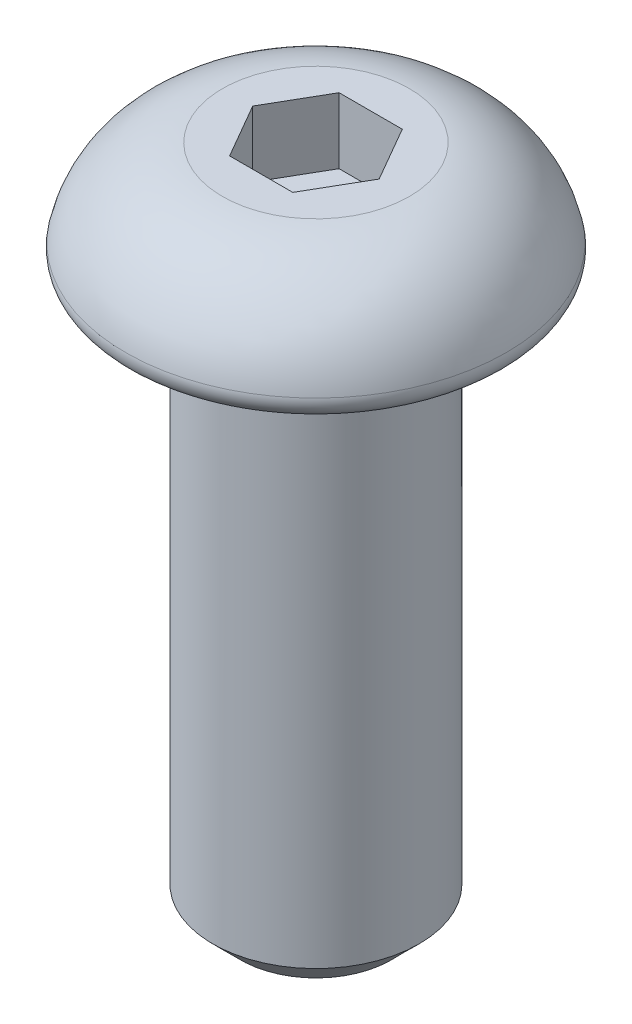
ISO-10303-21;
HEADER;
FILE_DESCRIPTION(('STEP AP214'),'2;1');
FILE_NAME('part.step','',(''),(''),'','','');
FILE_SCHEMA(('AUTOMOTIVE_DESIGN { 1 0 10303 214 1 1 1 1 }'));
ENDSEC;
DATA;
#1=APPLICATION_CONTEXT('core data for automotive mechanical design processes');
#2=APPLICATION_PROTOCOL_DEFINITION('international standard','automotive_design',2000,#1);
#3=PRODUCT_CONTEXT('',#1,'mechanical');
#4=PRODUCT('Part','Part','',(#3));
#5=PRODUCT_RELATED_PRODUCT_CATEGORY('part','',(#4));
#6=PRODUCT_DEFINITION_FORMATION('','',#4);
#7=PRODUCT_DEFINITION_CONTEXT('part definition',#1,'design');
#8=PRODUCT_DEFINITION('design','',#6,#7);
#9=PRODUCT_DEFINITION_SHAPE('','',#8);
#10=(LENGTH_UNIT() NAMED_UNIT(*) SI_UNIT(.MILLI.,.METRE.));
#11=(NAMED_UNIT(*) PLANE_ANGLE_UNIT() SI_UNIT($,.RADIAN.));
#12=(NAMED_UNIT(*) SI_UNIT($,.STERADIAN.) SOLID_ANGLE_UNIT());
#13=UNCERTAINTY_MEASURE_WITH_UNIT(LENGTH_MEASURE(1.E-05),#10,'distance_accuracy_value','');
#14=(GEOMETRIC_REPRESENTATION_CONTEXT(3) GLOBAL_UNCERTAINTY_ASSIGNED_CONTEXT((#13)) GLOBAL_UNIT_ASSIGNED_CONTEXT((#10,
#11,#12)) REPRESENTATION_CONTEXT('',''));
#15=CARTESIAN_POINT('',(0.,0.,0.));
#16=DIRECTION('',(0.,0.,1.));
#17=DIRECTION('',(1.,0.,0.));
#18=AXIS2_PLACEMENT_3D('',#15,#16,#17);
#19=CARTESIAN_POINT('',(0.,0.,0.));
#20=DIRECTION('',(0.,-1.,0.));
#21=DIRECTION('',(1.,0.,0.));
#22=AXIS2_PLACEMENT_3D('',#19,#20,#21);
#23=PLANE('',#22);
#24=CARTESIAN_POINT('',(0.,0.,0.));
#25=DIRECTION('',(0.,-1.,0.));
#26=DIRECTION('',(1.,0.,0.));
#27=AXIS2_PLACEMENT_3D('',#24,#25,#26);
#28=CIRCLE('',#27,2.0689086457345);
#29=CARTESIAN_POINT('',(2.0689086457345,0.,0.));
#30=VERTEX_POINT('',#29);
#31=EDGE_CURVE('E41',#30,#30,#28,.F.);
#32=ORIENTED_EDGE('',*,*,#31,.T.);
#33=EDGE_LOOP('',(#32));
#34=FACE_BOUND('',#33,.T.);
#35=CARTESIAN_POINT('',(0.,0.,0.));
#36=DIRECTION('',(0.,-1.,0.));
#37=DIRECTION('',(1.,0.,0.));
#38=AXIS2_PLACEMENT_3D('',#35,#36,#37);
#39=CIRCLE('',#38,2.921560184454);
#40=CARTESIAN_POINT('',(2.921560184454,0.,0.));
#41=VERTEX_POINT('',#40);
#42=EDGE_CURVE('E152',#41,#41,#39,.T.);
#43=ORIENTED_EDGE('',*,*,#42,.T.);
#44=EDGE_LOOP('',(#43));
#45=FACE_BOUND('',#44,.T.);
#46=ADVANCED_FACE('F33',(#34,#45),#23,.T.);
#47=CARTESIAN_POINT('',(0.,0.,0.));
#48=DIRECTION('',(0.,-1.,0.));
#49=DIRECTION('',(1.,0.,0.));
#50=AXIS2_PLACEMENT_3D('',#47,#48,#49);
#51=DEGENERATE_TOROIDAL_SURFACE('',#50,1.40765892856977,1.86290108459299,.T.);
#52=CARTESIAN_POINT('',(0.,0.380999999999906,0.));
#53=DIRECTION('',(0.,-1.,0.));
#54=DIRECTION('',(1.,0.,0.));
#55=AXIS2_PLACEMENT_3D('',#52,#53,#54);
#56=CIRCLE('',#55,3.23118283874419);
#57=CARTESIAN_POINT('',(3.23118283874419,0.380999999999907,0.));
#58=VERTEX_POINT('',#57);
#59=EDGE_CURVE('E11',#58,#58,#56,.F.);
#60=ORIENTED_EDGE('',*,*,#59,.T.);
#61=EDGE_LOOP('',(#60));
#62=FACE_BOUND('',#61,.T.);
#63=CARTESIAN_POINT('',(0.,1.85420000000036,0.));
#64=DIRECTION('',(0.,-1.,0.));
#65=DIRECTION('',(1.,0.,0.));
#66=AXIS2_PLACEMENT_3D('',#63,#64,#65);
#67=CIRCLE('',#66,1.58750000000907);
#68=CARTESIAN_POINT('',(1.58750000000907,1.85420000000036,0.));
#69=VERTEX_POINT('',#68);
#70=EDGE_CURVE('E135',#69,#69,#67,.T.);
#71=ORIENTED_EDGE('',*,*,#70,.T.);
#72=EDGE_LOOP('',(#71));
#73=FACE_BOUND('',#72,.T.);
#74=ADVANCED_FACE('F187',(#62,#73),#51,.T.);
#75=CARTESIAN_POINT('',(1.58750000000907,1.85420000000036,0.));
#76=DIRECTION('',(0.,1.,0.));
#77=DIRECTION('',(-1.,0.,0.));
#78=AXIS2_PLACEMENT_3D('',#75,#76,#77);
#79=PLANE('',#78);
#80=DIRECTION('',(-1.,0.,0.));
#81=VECTOR('',#80,1.);
#82=CARTESIAN_POINT('',(0.536574999999984,1.85420000000036,-0.929375162071291));
#83=LINE('',#82,#81);
#84=CARTESIAN_POINT('',(0.536574999999984,1.85420000000036,-0.929375162071291));
#85=VERTEX_POINT('',#84);
#86=CARTESIAN_POINT('',(-0.536575,1.85420000000036,-0.9293751620713));
#87=VERTEX_POINT('',#86);
#88=EDGE_CURVE('E48',#85,#87,#83,.T.);
#89=ORIENTED_EDGE('',*,*,#88,.F.);
#90=DIRECTION('',(-0.50000000000001,0.,-0.866025403784433));
#91=VECTOR('',#90,1.);
#92=CARTESIAN_POINT('',(1.07315000000002,1.85420000000036,0.));
#93=LINE('',#92,#91);
#94=CARTESIAN_POINT('',(1.07315000000002,1.85420000000036,0.));
#95=VERTEX_POINT('',#94);
#96=EDGE_CURVE('E131',#95,#85,#93,.T.);
#97=ORIENTED_EDGE('',*,*,#96,.F.);
#98=DIRECTION('',(0.500000000000002,0.,-0.866025403784437));
#99=VECTOR('',#98,1.);
#100=CARTESIAN_POINT('',(0.536575,1.85420000000036,0.9293751620713));
#101=LINE('',#100,#99);
#102=CARTESIAN_POINT('',(0.536575,1.85420000000036,0.9293751620713));
#103=VERTEX_POINT('',#102);
#104=EDGE_CURVE('E129',#103,#95,#101,.T.);
#105=ORIENTED_EDGE('',*,*,#104,.F.);
#106=DIRECTION('',(1.,0.,0.));
#107=VECTOR('',#106,1.);
#108=CARTESIAN_POINT('',(-0.536574999999992,1.85420000000036,0.929375162071296));
#109=LINE('',#108,#107);
#110=CARTESIAN_POINT('',(-0.536574999999992,1.85420000000036,0.929375162071296));
#111=VERTEX_POINT('',#110);
#112=EDGE_CURVE('E96',#111,#103,#109,.T.);
#113=ORIENTED_EDGE('',*,*,#112,.F.);
#114=DIRECTION('',(0.500000000000002,0.,0.866025403784437));
#115=VECTOR('',#114,1.);
#116=CARTESIAN_POINT('',(-1.07315000000002,1.85420000000036,0.));
#117=LINE('',#116,#115);
#118=CARTESIAN_POINT('',(-1.07315000000002,1.85420000000036,0.));
#119=VERTEX_POINT('',#118);
#120=EDGE_CURVE('E125',#119,#111,#117,.T.);
#121=ORIENTED_EDGE('',*,*,#120,.F.);
#122=DIRECTION('',(-0.500000000000002,0.,0.866025403784437));
#123=VECTOR('',#122,1.);
#124=CARTESIAN_POINT('',(-0.536575,1.85420000000036,-0.9293751620713));
#125=LINE('',#124,#123);
#126=EDGE_CURVE('E122',#87,#119,#125,.T.);
#127=ORIENTED_EDGE('',*,*,#126,.F.);
#128=EDGE_LOOP('',(#89,#97,#105,#113,#121,#127));
#129=FACE_BOUND('',#128,.T.);
#130=ORIENTED_EDGE('',*,*,#70,.F.);
#131=EDGE_LOOP('',(#130));
#132=FACE_BOUND('',#131,.T.);
#133=ADVANCED_FACE('F169',(#129,#132),#79,.T.);
#134=CARTESIAN_POINT('',(0.,-9.525,0.));
#135=DIRECTION('',(0.,1.,0.));
#136=DIRECTION('',(0.,0.,1.));
#137=AXIS2_PLACEMENT_3D('',#134,#135,#136);
#138=CYLINDRICAL_SURFACE('',#137,1.7526);
#139=CARTESIAN_POINT('',(0.,-0.3163086457345,0.));
#140=DIRECTION('',(0.,-1.,0.));
#141=DIRECTION('',(1.,0.,0.));
#142=AXIS2_PLACEMENT_3D('',#139,#140,#141);
#143=CIRCLE('',#142,1.7526);
#144=CARTESIAN_POINT('',(1.7526,-0.3163086457345,0.));
#145=VERTEX_POINT('',#144);
#146=EDGE_CURVE('E149',#145,#145,#143,.T.);
#147=ORIENTED_EDGE('',*,*,#146,.T.);
#148=EDGE_LOOP('',(#147));
#149=FACE_BOUND('',#148,.T.);
#150=CARTESIAN_POINT('',(0.,-9.05255999995575,0.));
#151=DIRECTION('',(0.,-1.,0.));
#152=DIRECTION('',(0.,0.,-1.));
#153=AXIS2_PLACEMENT_3D('',#150,#151,#152);
#154=CIRCLE('',#153,1.7526);
#155=CARTESIAN_POINT('',(0.,-9.05255999995575,-1.7526));
#156=VERTEX_POINT('',#155);
#157=EDGE_CURVE('E146',#156,#156,#154,.F.);
#158=ORIENTED_EDGE('',*,*,#157,.T.);
#159=EDGE_LOOP('',(#158));
#160=FACE_BOUND('',#159,.T.);
#161=ADVANCED_FACE('F165',(#149,#160),#138,.T.);
#162=CARTESIAN_POINT('',(0.,-9.525,0.));
#163=DIRECTION('',(0.,-1.,0.));
#164=DIRECTION('',(0.,0.,-1.));
#165=AXIS2_PLACEMENT_3D('',#162,#163,#164);
#166=PLANE('',#165);
#167=CARTESIAN_POINT('',(0.,-9.525,0.));
#168=DIRECTION('',(0.,-1.,0.));
#169=DIRECTION('',(0.,0.,-1.));
#170=AXIS2_PLACEMENT_3D('',#167,#168,#169);
#171=CIRCLE('',#170,1.28016000001259);
#172=CARTESIAN_POINT('',(0.,-9.525,-1.28016000001259));
#173=VERTEX_POINT('',#172);
#174=EDGE_CURVE('E143',#173,#173,#171,.T.);
#175=ORIENTED_EDGE('',*,*,#174,.T.);
#176=EDGE_LOOP('',(#175));
#177=FACE_BOUND('',#176,.T.);
#178=ADVANCED_FACE('F168',(#177),#166,.T.);
#179=CARTESIAN_POINT('',(0.536574999999984,0.736600000000355,-0.929375162071291));
#180=DIRECTION('',(0.,0.,-1.));
#181=DIRECTION('',(-1.,0.,0.));
#182=AXIS2_PLACEMENT_3D('',#179,#180,#181);
#183=PLANE('',#182);
#184=ORIENTED_EDGE('',*,*,#88,.T.);
#185=DIRECTION('',(0.,1.,0.));
#186=VECTOR('',#185,1.);
#187=CARTESIAN_POINT('',(-0.536575,0.736600000000355,-0.9293751620713));
#188=LINE('',#187,#186);
#189=CARTESIAN_POINT('',(-0.536575,0.736600000000355,-0.9293751620713));
#190=VERTEX_POINT('',#189);
#191=EDGE_CURVE('E78',#190,#87,#188,.T.);
#192=ORIENTED_EDGE('',*,*,#191,.F.);
#193=DIRECTION('',(-1.,0.,0.));
#194=VECTOR('',#193,1.);
#195=CARTESIAN_POINT('',(0.536574999999984,0.736600000000355,-0.929375162071291));
#196=LINE('',#195,#194);
#197=CARTESIAN_POINT('',(0.536574999999984,0.736600000000355,-0.929375162071291));
#198=VERTEX_POINT('',#197);
#199=EDGE_CURVE('E133',#198,#190,#196,.T.);
#200=ORIENTED_EDGE('',*,*,#199,.F.);
#201=DIRECTION('',(0.,1.,0.));
#202=VECTOR('',#201,1.);
#203=CARTESIAN_POINT('',(0.536574999999984,0.736600000000355,-0.929375162071291));
#204=LINE('',#203,#202);
#205=EDGE_CURVE('E56',#198,#85,#204,.T.);
#206=ORIENTED_EDGE('',*,*,#205,.T.);
#207=EDGE_LOOP('',(#184,#192,#200,#206));
#208=FACE_BOUND('',#207,.T.);
#209=ADVANCED_FACE('F179',(#208),#183,.F.);
#210=CARTESIAN_POINT('',(1.07315000000002,0.736600000000355,0.));
#211=DIRECTION('',(0.866025403784433,0.,-0.500000000000009));
#212=DIRECTION('',(-0.50000000000001,0.,-0.866025403784433));
#213=AXIS2_PLACEMENT_3D('',#210,#211,#212);
#214=PLANE('',#213);
#215=ORIENTED_EDGE('',*,*,#96,.T.);
#216=ORIENTED_EDGE('',*,*,#205,.F.);
#217=DIRECTION('',(-0.50000000000001,0.,-0.866025403784433));
#218=VECTOR('',#217,1.);
#219=CARTESIAN_POINT('',(1.07315000000002,0.736600000000355,0.));
#220=LINE('',#219,#218);
#221=CARTESIAN_POINT('',(1.07315000000002,0.736600000000355,0.));
#222=VERTEX_POINT('',#221);
#223=EDGE_CURVE('E108',#222,#198,#220,.T.);
#224=ORIENTED_EDGE('',*,*,#223,.F.);
#225=DIRECTION('',(0.,1.,0.));
#226=VECTOR('',#225,1.);
#227=CARTESIAN_POINT('',(1.07315000000002,0.736600000000355,0.));
#228=LINE('',#227,#226);
#229=EDGE_CURVE('E100',#222,#95,#228,.T.);
#230=ORIENTED_EDGE('',*,*,#229,.T.);
#231=EDGE_LOOP('',(#215,#216,#224,#230));
#232=FACE_BOUND('',#231,.T.);
#233=ADVANCED_FACE('F184',(#232),#214,.F.);
#234=CARTESIAN_POINT('',(0.536575,0.736600000000355,0.9293751620713));
#235=DIRECTION('',(0.866025403784437,0.,0.500000000000002));
#236=DIRECTION('',(0.500000000000002,0.,-0.866025403784437));
#237=AXIS2_PLACEMENT_3D('',#234,#235,#236);
#238=PLANE('',#237);
#239=ORIENTED_EDGE('',*,*,#104,.T.);
#240=ORIENTED_EDGE('',*,*,#229,.F.);
#241=DIRECTION('',(0.500000000000002,0.,-0.866025403784437));
#242=VECTOR('',#241,1.);
#243=CARTESIAN_POINT('',(0.536575,0.736600000000355,0.9293751620713));
#244=LINE('',#243,#242);
#245=CARTESIAN_POINT('',(0.536575,0.736600000000355,0.9293751620713));
#246=VERTEX_POINT('',#245);
#247=EDGE_CURVE('E104',#246,#222,#244,.T.);
#248=ORIENTED_EDGE('',*,*,#247,.F.);
#249=DIRECTION('',(0.,1.,0.));
#250=VECTOR('',#249,1.);
#251=CARTESIAN_POINT('',(0.536575,0.736600000000355,0.9293751620713));
#252=LINE('',#251,#250);
#253=EDGE_CURVE('E89',#246,#103,#252,.T.);
#254=ORIENTED_EDGE('',*,*,#253,.T.);
#255=EDGE_LOOP('',(#239,#240,#248,#254));
#256=FACE_BOUND('',#255,.T.);
#257=ADVANCED_FACE('F105',(#256),#238,.F.);
#258=CARTESIAN_POINT('',(-0.536574999999992,0.736600000000355,0.929375162071296));
#259=DIRECTION('',(0.,0.,1.));
#260=DIRECTION('',(1.,0.,0.));
#261=AXIS2_PLACEMENT_3D('',#258,#259,#260);
#262=PLANE('',#261);
#263=ORIENTED_EDGE('',*,*,#112,.T.);
#264=ORIENTED_EDGE('',*,*,#253,.F.);
#265=DIRECTION('',(1.,0.,0.));
#266=VECTOR('',#265,1.);
#267=CARTESIAN_POINT('',(-0.536574999999992,0.736600000000355,0.929375162071296));
#268=LINE('',#267,#266);
#269=CARTESIAN_POINT('',(-0.536574999999992,0.736600000000355,0.929375162071296));
#270=VERTEX_POINT('',#269);
#271=EDGE_CURVE('E93',#270,#246,#268,.T.);
#272=ORIENTED_EDGE('',*,*,#271,.F.);
#273=DIRECTION('',(0.,1.,0.));
#274=VECTOR('',#273,1.);
#275=CARTESIAN_POINT('',(-0.536574999999992,0.736600000000355,0.929375162071296));
#276=LINE('',#275,#274);
#277=EDGE_CURVE('E101',#270,#111,#276,.T.);
#278=ORIENTED_EDGE('',*,*,#277,.T.);
#279=EDGE_LOOP('',(#263,#264,#272,#278));
#280=FACE_BOUND('',#279,.T.);
#281=ADVANCED_FACE('F91',(#280),#262,.F.);
#282=CARTESIAN_POINT('',(-1.07315000000002,0.736600000000355,0.));
#283=DIRECTION('',(-0.866025403784437,0.,0.500000000000002));
#284=DIRECTION('',(0.500000000000002,0.,0.866025403784437));
#285=AXIS2_PLACEMENT_3D('',#282,#283,#284);
#286=PLANE('',#285);
#287=ORIENTED_EDGE('',*,*,#120,.T.);
#288=ORIENTED_EDGE('',*,*,#277,.F.);
#289=DIRECTION('',(0.500000000000002,0.,0.866025403784437));
#290=VECTOR('',#289,1.);
#291=CARTESIAN_POINT('',(-1.07315000000002,0.736600000000355,0.));
#292=LINE('',#291,#290);
#293=CARTESIAN_POINT('',(-1.07315000000002,0.736600000000355,0.));
#294=VERTEX_POINT('',#293);
#295=EDGE_CURVE('E114',#294,#270,#292,.T.);
#296=ORIENTED_EDGE('',*,*,#295,.F.);
#297=DIRECTION('',(0.,1.,0.));
#298=VECTOR('',#297,1.);
#299=CARTESIAN_POINT('',(-1.07315000000002,0.736600000000355,0.));
#300=LINE('',#299,#298);
#301=EDGE_CURVE('E138',#294,#119,#300,.T.);
#302=ORIENTED_EDGE('',*,*,#301,.T.);
#303=EDGE_LOOP('',(#287,#288,#296,#302));
#304=FACE_BOUND('',#303,.T.);
#305=ADVANCED_FACE('F218',(#304),#286,.F.);
#306=CARTESIAN_POINT('',(-0.536575,0.736600000000355,-0.9293751620713));
#307=DIRECTION('',(-0.866025403784437,0.,-0.500000000000002));
#308=DIRECTION('',(-0.500000000000002,0.,0.866025403784437));
#309=AXIS2_PLACEMENT_3D('',#306,#307,#308);
#310=PLANE('',#309);
#311=ORIENTED_EDGE('',*,*,#126,.T.);
#312=ORIENTED_EDGE('',*,*,#301,.F.);
#313=DIRECTION('',(-0.500000000000002,0.,0.866025403784437));
#314=VECTOR('',#313,1.);
#315=CARTESIAN_POINT('',(-0.536575,0.736600000000355,-0.9293751620713));
#316=LINE('',#315,#314);
#317=EDGE_CURVE('E116',#190,#294,#316,.T.);
#318=ORIENTED_EDGE('',*,*,#317,.F.);
#319=ORIENTED_EDGE('',*,*,#191,.T.);
#320=EDGE_LOOP('',(#311,#312,#318,#319));
#321=FACE_BOUND('',#320,.T.);
#322=ADVANCED_FACE('F206',(#321),#310,.F.);
#323=CARTESIAN_POINT('',(0.,0.736600000000355,0.));
#324=DIRECTION('',(0.,1.,0.));
#325=DIRECTION('',(0.,0.,1.));
#326=AXIS2_PLACEMENT_3D('',#323,#324,#325);
#327=PLANE('',#326);
#328=ORIENTED_EDGE('',*,*,#199,.T.);
#329=ORIENTED_EDGE('',*,*,#317,.T.);
#330=ORIENTED_EDGE('',*,*,#295,.T.);
#331=ORIENTED_EDGE('',*,*,#271,.T.);
#332=ORIENTED_EDGE('',*,*,#247,.T.);
#333=ORIENTED_EDGE('',*,*,#223,.T.);
#334=EDGE_LOOP('',(#328,#329,#330,#331,#332,#333));
#335=FACE_BOUND('',#334,.T.);
#336=ADVANCED_FACE('F111',(#335),#327,.T.);
#337=CARTESIAN_POINT('',(0.,-9.525,0.));
#338=DIRECTION('',(0.,1.,0.));
#339=DIRECTION('',(0.,0.,1.));
#340=AXIS2_PLACEMENT_3D('',#337,#338,#339);
#341=CONICAL_SURFACE('',#340,1.28016000001259,0.785398163337286);
#342=ORIENTED_EDGE('',*,*,#157,.F.);
#343=EDGE_LOOP('',(#342));
#344=FACE_BOUND('',#343,.T.);
#345=ORIENTED_EDGE('',*,*,#174,.F.);
#346=EDGE_LOOP('',(#345));
#347=FACE_BOUND('',#346,.T.);
#348=ADVANCED_FACE('F162',(#344,#347),#341,.T.);
#349=CARTESIAN_POINT('',(0.,-0.3163086457345,0.));
#350=DIRECTION('',(0.,-1.,0.));
#351=DIRECTION('',(1.,0.,0.));
#352=AXIS2_PLACEMENT_3D('',#349,#350,#351);
#353=TOROIDAL_SURFACE('',#352,2.0689086457345,0.3163086457345);
#354=ORIENTED_EDGE('',*,*,#31,.F.);
#355=EDGE_LOOP('',(#354));
#356=FACE_BOUND('',#355,.T.);
#357=ORIENTED_EDGE('',*,*,#146,.F.);
#358=EDGE_LOOP('',(#357));
#359=FACE_BOUND('',#358,.T.);
#360=ADVANCED_FACE('F159',(#356,#359),#353,.F.);
#361=CARTESIAN_POINT('',(0.,0.3163086457345,0.));
#362=DIRECTION('',(0.,-1.,0.));
#363=DIRECTION('',(1.,0.,0.));
#364=AXIS2_PLACEMENT_3D('',#361,#362,#363);
#365=TOROIDAL_SURFACE('',#364,2.921560184454,0.3163086457345);
#366=ORIENTED_EDGE('',*,*,#59,.F.);
#367=EDGE_LOOP('',(#366));
#368=FACE_BOUND('',#367,.T.);
#369=ORIENTED_EDGE('',*,*,#42,.F.);
#370=EDGE_LOOP('',(#369));
#371=FACE_BOUND('',#370,.T.);
#372=ADVANCED_FACE('F35',(#368,#371),#365,.T.);
#373=CLOSED_SHELL('',(#46,#74,#133,#161,#178,#209,#233,#257,#281,#305,#322,#336,#348,#360,#372));
#374=MANIFOLD_SOLID_BREP('B2',#373);
#375=ADVANCED_BREP_SHAPE_REPRESENTATION('',(#18,#374),#14);
#376=SHAPE_DEFINITION_REPRESENTATION(#9,#375);
ENDSEC;
END-ISO-10303-21;
